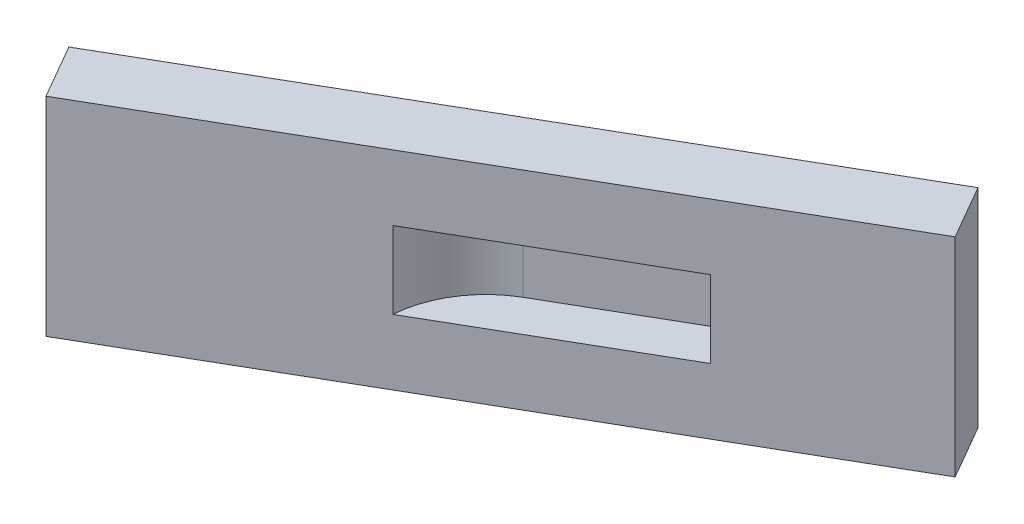
ISO-10303-21;
HEADER;
FILE_DESCRIPTION(('STEP AP214'),'2;1');
FILE_NAME('part.step','',(''),(''),'','','');
FILE_SCHEMA(('AUTOMOTIVE_DESIGN { 1 0 10303 214 1 1 1 1 }'));
ENDSEC;
DATA;
#1=APPLICATION_CONTEXT('core data for automotive mechanical design processes');
#2=APPLICATION_PROTOCOL_DEFINITION('international standard','automotive_design',2000,#1);
#3=PRODUCT_CONTEXT('',#1,'mechanical');
#4=PRODUCT('Part','Part','',(#3));
#5=PRODUCT_RELATED_PRODUCT_CATEGORY('part','',(#4));
#6=PRODUCT_DEFINITION_FORMATION('','',#4);
#7=PRODUCT_DEFINITION_CONTEXT('part definition',#1,'design');
#8=PRODUCT_DEFINITION('design','',#6,#7);
#9=PRODUCT_DEFINITION_SHAPE('','',#8);
#10=(LENGTH_UNIT() NAMED_UNIT(*) SI_UNIT(.MILLI.,.METRE.));
#11=(NAMED_UNIT(*) PLANE_ANGLE_UNIT() SI_UNIT($,.RADIAN.));
#12=(NAMED_UNIT(*) SI_UNIT($,.STERADIAN.) SOLID_ANGLE_UNIT());
#13=UNCERTAINTY_MEASURE_WITH_UNIT(LENGTH_MEASURE(1.E-05),#10,'distance_accuracy_value','');
#14=(GEOMETRIC_REPRESENTATION_CONTEXT(3) GLOBAL_UNCERTAINTY_ASSIGNED_CONTEXT((#13)) GLOBAL_UNIT_ASSIGNED_CONTEXT((#10,
#11,#12)) REPRESENTATION_CONTEXT('',''));
#15=CARTESIAN_POINT('',(0.,0.,0.));
#16=DIRECTION('',(0.,0.,1.));
#17=DIRECTION('',(1.,0.,0.));
#18=AXIS2_PLACEMENT_3D('',#15,#16,#17);
#19=CARTESIAN_POINT('',(-5.03311958870409,-5.,-8.71761884820565));
#20=DIRECTION('',(-0.5,0.,-0.866025403784439));
#21=DIRECTION('',(-0.866025403784439,0.,0.5));
#22=AXIS2_PLACEMENT_3D('',#19,#20,#21);
#23=PLANE('',#22);
#24=DIRECTION('',(0.,1.,0.));
#25=VECTOR('',#24,1.);
#26=CARTESIAN_POINT('',(-5.65631853018422,-5.,-8.35781477158341));
#27=LINE('',#26,#25);
#28=CARTESIAN_POINT('',(-5.65631853018422,-1.85,-8.35781477158341));
#29=VERTEX_POINT('',#28);
#30=CARTESIAN_POINT('',(-5.65631853018422,1.85,-8.35781477158341));
#31=VERTEX_POINT('',#30);
#32=EDGE_CURVE('E157',#29,#31,#27,.T.);
#33=ORIENTED_EDGE('',*,*,#32,.F.);
#34=DIRECTION('',(-0.866025403784439,0.,0.5));
#35=VECTOR('',#34,1.);
#36=CARTESIAN_POINT('',(-5.03311958870409,-1.85,-8.71761884820565));
#37=LINE('',#36,#35);
#38=CARTESIAN_POINT('',(-15.34252832128,-1.85,-2.76547894126709));
#39=VERTEX_POINT('',#38);
#40=EDGE_CURVE('E11',#29,#39,#37,.T.);
#41=ORIENTED_EDGE('',*,*,#40,.T.);
#42=DIRECTION('',(0.,1.,0.));
#43=VECTOR('',#42,1.);
#44=CARTESIAN_POINT('',(-15.34252832128,-1.85,-2.76547894126709));
#45=LINE('',#44,#43);
#46=CARTESIAN_POINT('',(-15.34252832128,1.85,-2.76547894126709));
#47=VERTEX_POINT('',#46);
#48=EDGE_CURVE('E42',#47,#39,#45,.F.);
#49=ORIENTED_EDGE('',*,*,#48,.F.);
#50=DIRECTION('',(-0.866025403784439,0.,0.5));
#51=VECTOR('',#50,1.);
#52=CARTESIAN_POINT('',(-5.03311958870409,1.85,-8.71761884820565));
#53=LINE('',#52,#51);
#54=EDGE_CURVE('E150',#31,#47,#53,.T.);
#55=ORIENTED_EDGE('',*,*,#54,.F.);
#56=EDGE_LOOP('',(#33,#41,#49,#55));
#57=FACE_BOUND('',#56,.T.);
#58=DIRECTION('',(0.,1.,0.));
#59=VECTOR('',#58,1.);
#60=CARTESIAN_POINT('',(1.79527845875009,-5.,-12.6599962990372));
#61=LINE('',#60,#59);
#62=CARTESIAN_POINT('',(1.79527845875009,-5.,-12.6599962990372));
#63=VERTEX_POINT('',#62);
#64=CARTESIAN_POINT('',(1.79527845875009,5.,-12.6599962990372));
#65=VERTEX_POINT('',#64);
#66=EDGE_CURVE('E147',#63,#65,#61,.T.);
#67=ORIENTED_EDGE('',*,*,#66,.T.);
#68=DIRECTION('',(-0.866025403784439,0.,0.5));
#69=VECTOR('',#68,1.);
#70=CARTESIAN_POINT('',(-5.03311958870409,5.,-8.71761884820565));
#71=LINE('',#70,#69);
#72=CARTESIAN_POINT('',(-25.9175344623519,5.,3.34000370096276));
#73=VERTEX_POINT('',#72);
#74=EDGE_CURVE('E127',#65,#73,#71,.T.);
#75=ORIENTED_EDGE('',*,*,#74,.T.);
#76=DIRECTION('',(0.,1.,0.));
#77=VECTOR('',#76,1.);
#78=CARTESIAN_POINT('',(-25.9175344623519,-5.,3.34000370096276));
#79=LINE('',#78,#77);
#80=CARTESIAN_POINT('',(-25.9175344623519,-5.,3.34000370096276));
#81=VERTEX_POINT('',#80);
#82=EDGE_CURVE('E148',#81,#73,#79,.T.);
#83=ORIENTED_EDGE('',*,*,#82,.F.);
#84=DIRECTION('',(-0.866025403784439,0.,0.5));
#85=VECTOR('',#84,1.);
#86=CARTESIAN_POINT('',(-5.03311958870409,-5.,-8.71761884820565));
#87=LINE('',#86,#85);
#88=EDGE_CURVE('E140',#63,#81,#87,.T.);
#89=ORIENTED_EDGE('',*,*,#88,.F.);
#90=EDGE_LOOP('',(#67,#75,#83,#89));
#91=FACE_BOUND('',#90,.T.);
#92=ADVANCED_FACE('F35',(#57,#91),#23,.F.);
#93=CARTESIAN_POINT('',(-20.8844148736479,-5.,12.0576225491684));
#94=DIRECTION('',(0.866025403784439,0.,-0.5));
#95=DIRECTION('',(-0.5,0.,-0.866025403784439));
#96=AXIS2_PLACEMENT_3D('',#93,#94,#95);
#97=PLANE('',#96);
#98=ORIENTED_EDGE('',*,*,#82,.T.);
#99=DIRECTION('',(-0.5,0.,-0.866025403784439));
#100=VECTOR('',#99,1.);
#101=CARTESIAN_POINT('',(-20.8844148736479,5.,12.0576225491684));
#102=LINE('',#101,#100);
#103=CARTESIAN_POINT('',(-27.4175344623519,5.,0.741927489609445));
#104=VERTEX_POINT('',#103);
#105=EDGE_CURVE('E137',#73,#104,#102,.T.);
#106=ORIENTED_EDGE('',*,*,#105,.T.);
#107=DIRECTION('',(0.,1.,0.));
#108=VECTOR('',#107,1.);
#109=CARTESIAN_POINT('',(-27.4175344623519,-5.,0.741927489609445));
#110=LINE('',#109,#108);
#111=CARTESIAN_POINT('',(-27.4175344623519,-5.,0.741927489609445));
#112=VERTEX_POINT('',#111);
#113=EDGE_CURVE('E151',#112,#104,#110,.T.);
#114=ORIENTED_EDGE('',*,*,#113,.F.);
#115=DIRECTION('',(-0.5,0.,-0.866025403784439));
#116=VECTOR('',#115,1.);
#117=CARTESIAN_POINT('',(-20.8844148736479,-5.,12.0576225491684));
#118=LINE('',#117,#116);
#119=EDGE_CURVE('E57',#81,#112,#118,.T.);
#120=ORIENTED_EDGE('',*,*,#119,.F.);
#121=EDGE_LOOP('',(#98,#106,#114,#120));
#122=FACE_BOUND('',#121,.T.);
#123=ADVANCED_FACE('F176',(#122),#97,.F.);
#124=CARTESIAN_POINT('',(-6.53311958870409,-5.,-11.315695059559));
#125=DIRECTION('',(0.5,0.,0.866025403784439));
#126=DIRECTION('',(0.866025403784439,0.,-0.5));
#127=AXIS2_PLACEMENT_3D('',#124,#125,#126);
#128=PLANE('',#127);
#129=ORIENTED_EDGE('',*,*,#113,.T.);
#130=DIRECTION('',(0.866025403784439,0.,-0.5));
#131=VECTOR('',#130,1.);
#132=CARTESIAN_POINT('',(-6.53311958870409,5.,-11.315695059559));
#133=LINE('',#132,#131);
#134=CARTESIAN_POINT('',(0.295278458750089,5.,-15.2580725103906));
#135=VERTEX_POINT('',#134);
#136=EDGE_CURVE('E134',#104,#135,#133,.T.);
#137=ORIENTED_EDGE('',*,*,#136,.T.);
#138=DIRECTION('',(0.,1.,0.));
#139=VECTOR('',#138,1.);
#140=CARTESIAN_POINT('',(0.295278458750089,-5.,-15.2580725103906));
#141=LINE('',#140,#139);
#142=CARTESIAN_POINT('',(0.295278458750089,-5.,-15.2580725103906));
#143=VERTEX_POINT('',#142);
#144=EDGE_CURVE('E153',#143,#135,#141,.T.);
#145=ORIENTED_EDGE('',*,*,#144,.F.);
#146=DIRECTION('',(0.866025403784439,0.,-0.5));
#147=VECTOR('',#146,1.);
#148=CARTESIAN_POINT('',(-6.53311958870409,-5.,-11.315695059559));
#149=LINE('',#148,#147);
#150=EDGE_CURVE('E144',#112,#143,#149,.T.);
#151=ORIENTED_EDGE('',*,*,#150,.F.);
#152=EDGE_LOOP('',(#129,#137,#145,#151));
#153=FACE_BOUND('',#152,.T.);
#154=ADVANCED_FACE('F180',(#153),#128,.F.);
#155=CARTESIAN_POINT('',(6.82839804745418,-5.,-3.94237745083158));
#156=DIRECTION('',(-0.866025403784439,0.,0.5));
#157=DIRECTION('',(0.5,0.,0.866025403784439));
#158=AXIS2_PLACEMENT_3D('',#155,#156,#157);
#159=PLANE('',#158);
#160=ORIENTED_EDGE('',*,*,#144,.T.);
#161=DIRECTION('',(0.5,0.,0.866025403784439));
#162=VECTOR('',#161,1.);
#163=CARTESIAN_POINT('',(6.82839804745418,5.,-3.94237745083158));
#164=LINE('',#163,#162);
#165=EDGE_CURVE('E131',#135,#65,#164,.T.);
#166=ORIENTED_EDGE('',*,*,#165,.T.);
#167=ORIENTED_EDGE('',*,*,#66,.F.);
#168=DIRECTION('',(0.5,0.,0.866025403784439));
#169=VECTOR('',#168,1.);
#170=CARTESIAN_POINT('',(6.82839804745418,-5.,-3.94237745083158));
#171=LINE('',#170,#169);
#172=EDGE_CURVE('E142',#143,#63,#171,.T.);
#173=ORIENTED_EDGE('',*,*,#172,.F.);
#174=EDGE_LOOP('',(#160,#166,#167,#173));
#175=FACE_BOUND('',#174,.T.);
#176=ADVANCED_FACE('F185',(#175),#159,.F.);
#177=CARTESIAN_POINT('',(0.,-5.,0.));
#178=DIRECTION('',(0.,1.,0.));
#179=DIRECTION('',(0.,0.,1.));
#180=AXIS2_PLACEMENT_3D('',#177,#178,#179);
#181=PLANE('',#180);
#182=ORIENTED_EDGE('',*,*,#88,.T.);
#183=ORIENTED_EDGE('',*,*,#119,.T.);
#184=ORIENTED_EDGE('',*,*,#150,.T.);
#185=ORIENTED_EDGE('',*,*,#172,.T.);
#186=EDGE_LOOP('',(#182,#183,#184,#185));
#187=FACE_BOUND('',#186,.T.);
#188=ADVANCED_FACE('F189',(#187),#181,.F.);
#189=CARTESIAN_POINT('',(0.,5.,0.));
#190=DIRECTION('',(0.,1.,0.));
#191=DIRECTION('',(0.,0.,1.));
#192=AXIS2_PLACEMENT_3D('',#189,#190,#191);
#193=PLANE('',#192);
#194=ORIENTED_EDGE('',*,*,#74,.F.);
#195=ORIENTED_EDGE('',*,*,#165,.F.);
#196=ORIENTED_EDGE('',*,*,#136,.F.);
#197=ORIENTED_EDGE('',*,*,#105,.F.);
#198=EDGE_LOOP('',(#194,#195,#196,#197));
#199=FACE_BOUND('',#198,.T.);
#200=ADVANCED_FACE('F196',(#199),#193,.T.);
#201=CARTESIAN_POINT('',(-10.5063185301842,-1.85,-2.4));
#202=DIRECTION('',(0.,1.,0.));
#203=DIRECTION('',(0.,0.,1.));
#204=AXIS2_PLACEMENT_3D('',#201,#202,#203);
#205=CYLINDRICAL_SURFACE('',#204,4.85);
#206=ORIENTED_EDGE('',*,*,#48,.T.);
#207=CARTESIAN_POINT('',(-10.5063185301842,-1.85,-2.4));
#208=DIRECTION('',(0.,-1.,0.));
#209=DIRECTION('',(0.,0.,-1.));
#210=AXIS2_PLACEMENT_3D('',#207,#208,#209);
#211=CIRCLE('',#210,4.85);
#212=CARTESIAN_POINT('',(-12.9313185301842,-1.85,-6.60022320835452));
#213=VERTEX_POINT('',#212);
#214=EDGE_CURVE('E110',#39,#213,#211,.T.);
#215=ORIENTED_EDGE('',*,*,#214,.T.);
#216=DIRECTION('',(0.,1.,0.));
#217=VECTOR('',#216,1.);
#218=CARTESIAN_POINT('',(-12.9313185301842,-1.85,-6.60022320835452));
#219=LINE('',#218,#217);
#220=CARTESIAN_POINT('',(-12.9313185301842,1.85,-6.60022320835452));
#221=VERTEX_POINT('',#220);
#222=EDGE_CURVE('E106',#213,#221,#219,.T.);
#223=ORIENTED_EDGE('',*,*,#222,.T.);
#224=CARTESIAN_POINT('',(-10.5063185301842,1.85,-2.4));
#225=DIRECTION('',(0.,-1.,0.));
#226=DIRECTION('',(0.,0.,-1.));
#227=AXIS2_PLACEMENT_3D('',#224,#225,#226);
#228=CIRCLE('',#227,4.85);
#229=EDGE_CURVE('E119',#47,#221,#228,.T.);
#230=ORIENTED_EDGE('',*,*,#229,.F.);
#231=EDGE_LOOP('',(#206,#215,#223,#230));
#232=FACE_BOUND('',#231,.T.);
#233=ADVANCED_FACE('F161',(#232),#205,.F.);
#234=CARTESIAN_POINT('',(-5.65631853018422,-1.85,-10.8004464167091));
#235=DIRECTION('',(-1.,0.,0.));
#236=DIRECTION('',(0.,0.,1.));
#237=AXIS2_PLACEMENT_3D('',#234,#235,#236);
#238=PLANE('',#237);
#239=ORIENTED_EDGE('',*,*,#32,.T.);
#240=DIRECTION('',(0.,0.,1.));
#241=VECTOR('',#240,1.);
#242=CARTESIAN_POINT('',(-5.65631853018422,1.85,-10.8004464167091));
#243=LINE('',#242,#241);
#244=CARTESIAN_POINT('',(-5.65631853018422,1.85,-10.8004464167091));
#245=VERTEX_POINT('',#244);
#246=EDGE_CURVE('E49',#245,#31,#243,.T.);
#247=ORIENTED_EDGE('',*,*,#246,.F.);
#248=DIRECTION('',(0.,1.,0.));
#249=VECTOR('',#248,1.);
#250=CARTESIAN_POINT('',(-5.65631853018422,-1.85,-10.8004464167091));
#251=LINE('',#250,#249);
#252=CARTESIAN_POINT('',(-5.65631853018422,-1.85,-10.8004464167091));
#253=VERTEX_POINT('',#252);
#254=EDGE_CURVE('E104',#253,#245,#251,.T.);
#255=ORIENTED_EDGE('',*,*,#254,.F.);
#256=DIRECTION('',(0.,0.,1.));
#257=VECTOR('',#256,1.);
#258=CARTESIAN_POINT('',(-5.65631853018422,-1.85,-10.8004464167091));
#259=LINE('',#258,#257);
#260=EDGE_CURVE('E111',#253,#29,#259,.T.);
#261=ORIENTED_EDGE('',*,*,#260,.T.);
#262=EDGE_LOOP('',(#239,#247,#255,#261));
#263=FACE_BOUND('',#262,.T.);
#264=ADVANCED_FACE('F115',(#263),#238,.T.);
#265=CARTESIAN_POINT('',(-10.5063185301842,-1.85,-2.4));
#266=DIRECTION('',(0.,-1.,0.));
#267=DIRECTION('',(0.,0.,-1.));
#268=AXIS2_PLACEMENT_3D('',#265,#266,#267);
#269=PLANE('',#268);
#270=ORIENTED_EDGE('',*,*,#260,.F.);
#271=DIRECTION('',(0.866025403784439,0.,-0.5));
#272=VECTOR('',#271,1.);
#273=CARTESIAN_POINT('',(-12.9313185301842,-1.85,-6.60022320835452));
#274=LINE('',#273,#272);
#275=EDGE_CURVE('E100',#213,#253,#274,.T.);
#276=ORIENTED_EDGE('',*,*,#275,.F.);
#277=ORIENTED_EDGE('',*,*,#214,.F.);
#278=ORIENTED_EDGE('',*,*,#40,.F.);
#279=EDGE_LOOP('',(#270,#276,#277,#278));
#280=FACE_BOUND('',#279,.T.);
#281=ADVANCED_FACE('F118',(#280),#269,.F.);
#282=CARTESIAN_POINT('',(-10.5063185301842,1.85,-2.4));
#283=DIRECTION('',(0.,-1.,0.));
#284=DIRECTION('',(0.,0.,-1.));
#285=AXIS2_PLACEMENT_3D('',#282,#283,#284);
#286=PLANE('',#285);
#287=ORIENTED_EDGE('',*,*,#54,.T.);
#288=ORIENTED_EDGE('',*,*,#229,.T.);
#289=DIRECTION('',(0.866025403784439,0.,-0.5));
#290=VECTOR('',#289,1.);
#291=CARTESIAN_POINT('',(-12.9313185301842,1.85,-6.60022320835452));
#292=LINE('',#291,#290);
#293=EDGE_CURVE('E121',#221,#245,#292,.T.);
#294=ORIENTED_EDGE('',*,*,#293,.T.);
#295=ORIENTED_EDGE('',*,*,#246,.T.);
#296=EDGE_LOOP('',(#287,#288,#294,#295));
#297=FACE_BOUND('',#296,.T.);
#298=ADVANCED_FACE('F165',(#297),#286,.T.);
#299=CARTESIAN_POINT('',(-12.9313185301842,-1.85,-6.60022320835452));
#300=DIRECTION('',(0.5,0.,0.866025403784439));
#301=DIRECTION('',(0.866025403784439,0.,-0.5));
#302=AXIS2_PLACEMENT_3D('',#299,#300,#301);
#303=PLANE('',#302);
#304=ORIENTED_EDGE('',*,*,#293,.F.);
#305=ORIENTED_EDGE('',*,*,#222,.F.);
#306=ORIENTED_EDGE('',*,*,#275,.T.);
#307=ORIENTED_EDGE('',*,*,#254,.T.);
#308=EDGE_LOOP('',(#304,#305,#306,#307));
#309=FACE_BOUND('',#308,.T.);
#310=ADVANCED_FACE('F103',(#309),#303,.T.);
#311=CLOSED_SHELL('',(#92,#123,#154,#176,#188,#200,#233,#264,#281,#298,#310));
#312=MANIFOLD_SOLID_BREP('B2',#311);
#313=ADVANCED_BREP_SHAPE_REPRESENTATION('',(#18,#312),#14);
#314=SHAPE_DEFINITION_REPRESENTATION(#9,#313);
ENDSEC;
END-ISO-10303-21;
